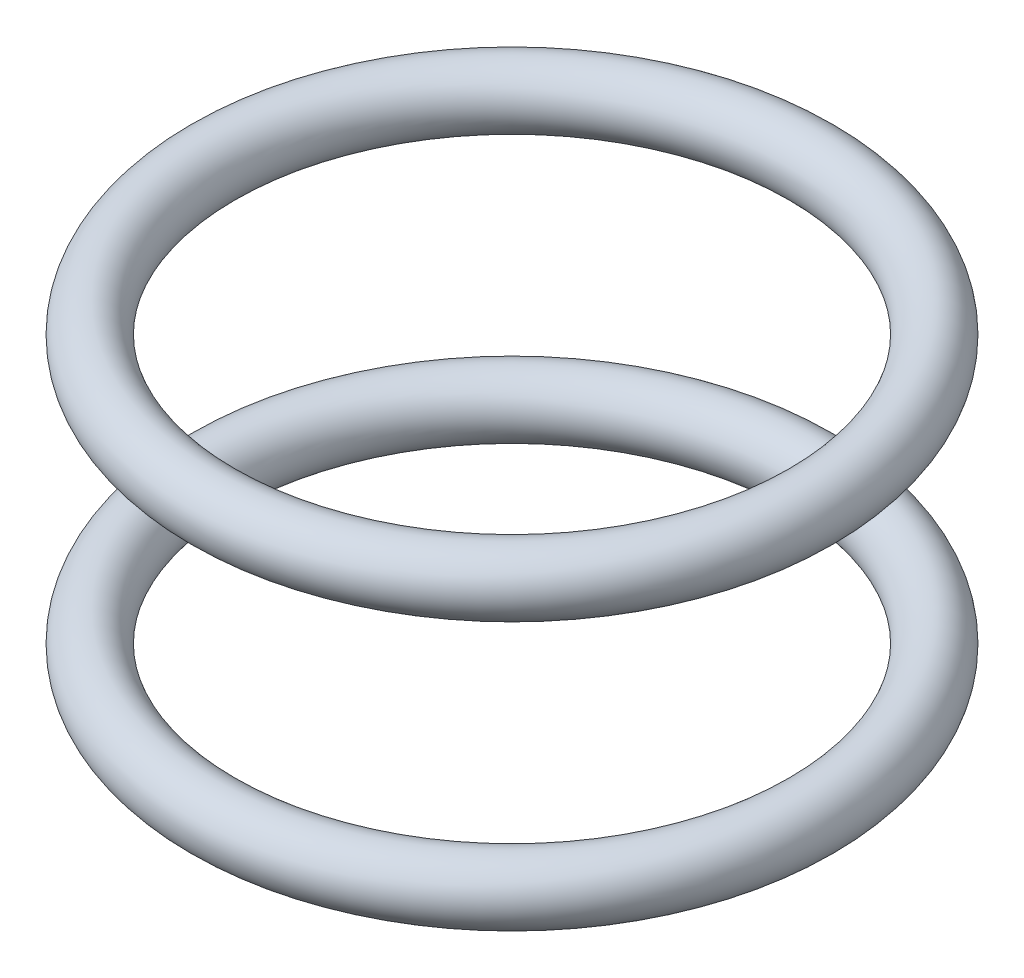
ISO-10303-21;
HEADER;
FILE_DESCRIPTION(('STEP AP214'),'2;1');
FILE_NAME('part.step','',(''),(''),'','','');
FILE_SCHEMA(('AUTOMOTIVE_DESIGN { 1 0 10303 214 1 1 1 1 }'));
ENDSEC;
DATA;
#1=APPLICATION_CONTEXT('core data for automotive mechanical design processes');
#2=APPLICATION_PROTOCOL_DEFINITION('international standard','automotive_design',2000,#1);
#3=PRODUCT_CONTEXT('',#1,'mechanical');
#4=PRODUCT('Part','Part','',(#3));
#5=PRODUCT_RELATED_PRODUCT_CATEGORY('part','',(#4));
#6=PRODUCT_DEFINITION_FORMATION('','',#4);
#7=PRODUCT_DEFINITION_CONTEXT('part definition',#1,'design');
#8=PRODUCT_DEFINITION('design','',#6,#7);
#9=PRODUCT_DEFINITION_SHAPE('','',#8);
#10=(LENGTH_UNIT() NAMED_UNIT(*) SI_UNIT(.MILLI.,.METRE.));
#11=(NAMED_UNIT(*) PLANE_ANGLE_UNIT() SI_UNIT($,.RADIAN.));
#12=(NAMED_UNIT(*) SI_UNIT($,.STERADIAN.) SOLID_ANGLE_UNIT());
#13=UNCERTAINTY_MEASURE_WITH_UNIT(LENGTH_MEASURE(1.E-05),#10,'distance_accuracy_value','');
#14=(GEOMETRIC_REPRESENTATION_CONTEXT(3) GLOBAL_UNCERTAINTY_ASSIGNED_CONTEXT((#13)) GLOBAL_UNIT_ASSIGNED_CONTEXT((#10,
#11,#12)) REPRESENTATION_CONTEXT('',''));
#15=CARTESIAN_POINT('',(0.,0.,0.));
#16=DIRECTION('',(0.,0.,1.));
#17=DIRECTION('',(1.,0.,0.));
#18=AXIS2_PLACEMENT_3D('',#15,#16,#17);
#19=CARTESIAN_POINT('',(0.,-6.5,0.));
#20=DIRECTION('',(0.,-1.,0.));
#21=DIRECTION('',(1.,0.,0.));
#22=AXIS2_PLACEMENT_3D('',#19,#20,#21);
#23=TOROIDAL_SURFACE('',#22,14.5,1.5);
#24=ADVANCED_FACE('P0_F14',(),#23,.T.);
#25=CLOSED_SHELL('',(#24));
#26=MANIFOLD_SOLID_BREP('P0_B1',#25);
#27=CARTESIAN_POINT('',(0.,6.5,0.));
#28=DIRECTION('',(0.,-1.,0.));
#29=DIRECTION('',(1.,0.,0.));
#30=AXIS2_PLACEMENT_3D('',#27,#28,#29);
#31=TOROIDAL_SURFACE('',#30,14.5,1.5);
#32=ADVANCED_FACE('P1_F14',(),#31,.T.);
#33=CLOSED_SHELL('',(#32));
#34=MANIFOLD_SOLID_BREP('P1_B1',#33);
#35=ADVANCED_BREP_SHAPE_REPRESENTATION('',(#18,#26,#34),#14);
#36=SHAPE_DEFINITION_REPRESENTATION(#9,#35);
ENDSEC;
END-ISO-10303-21;
